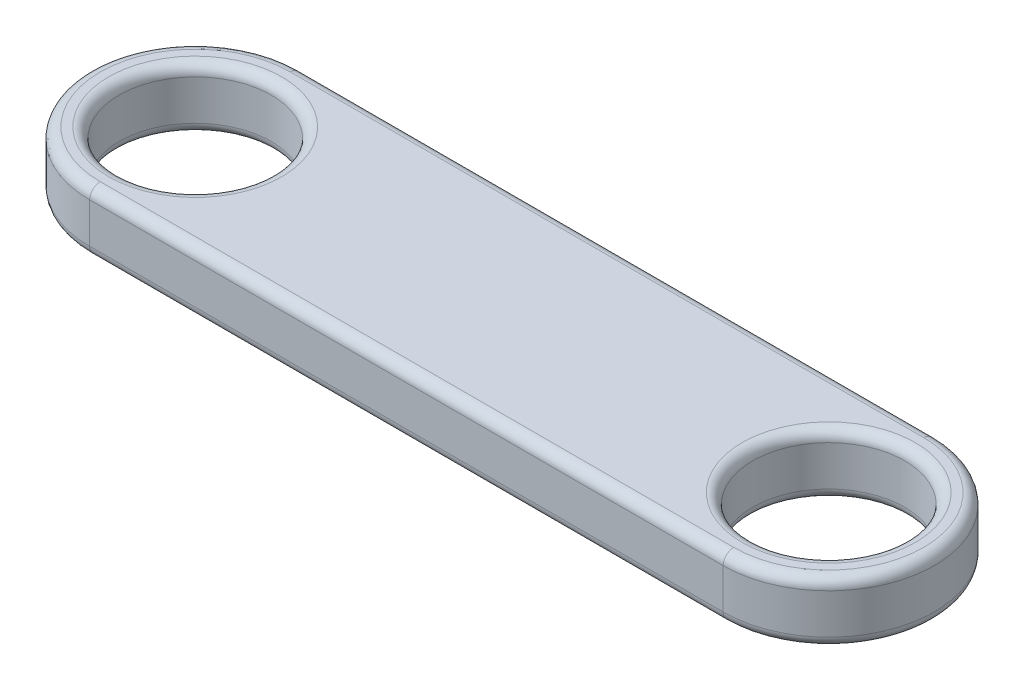
ISO-10303-21;
HEADER;
FILE_DESCRIPTION(('STEP AP214'),'2;1');
FILE_NAME('part.step','',(''),(''),'','','');
FILE_SCHEMA(('AUTOMOTIVE_DESIGN { 1 0 10303 214 1 1 1 1 }'));
ENDSEC;
DATA;
#1=APPLICATION_CONTEXT('core data for automotive mechanical design processes');
#2=APPLICATION_PROTOCOL_DEFINITION('international standard','automotive_design',2000,#1);
#3=PRODUCT_CONTEXT('',#1,'mechanical');
#4=PRODUCT('Part','Part','',(#3));
#5=PRODUCT_RELATED_PRODUCT_CATEGORY('part','',(#4));
#6=PRODUCT_DEFINITION_FORMATION('','',#4);
#7=PRODUCT_DEFINITION_CONTEXT('part definition',#1,'design');
#8=PRODUCT_DEFINITION('design','',#6,#7);
#9=PRODUCT_DEFINITION_SHAPE('','',#8);
#10=(LENGTH_UNIT() NAMED_UNIT(*) SI_UNIT(.MILLI.,.METRE.));
#11=(NAMED_UNIT(*) PLANE_ANGLE_UNIT() SI_UNIT($,.RADIAN.));
#12=(NAMED_UNIT(*) SI_UNIT($,.STERADIAN.) SOLID_ANGLE_UNIT());
#13=UNCERTAINTY_MEASURE_WITH_UNIT(LENGTH_MEASURE(1.E-05),#10,'distance_accuracy_value','');
#14=(GEOMETRIC_REPRESENTATION_CONTEXT(3) GLOBAL_UNCERTAINTY_ASSIGNED_CONTEXT((#13)) GLOBAL_UNIT_ASSIGNED_CONTEXT((#10,
#11,#12)) REPRESENTATION_CONTEXT('',''));
#15=CARTESIAN_POINT('',(0.,0.,0.));
#16=DIRECTION('',(0.,0.,1.));
#17=DIRECTION('',(1.,0.,0.));
#18=AXIS2_PLACEMENT_3D('',#15,#16,#17);
#19=CARTESIAN_POINT('',(0.,2.9,0.));
#20=DIRECTION('',(0.,1.,0.));
#21=DIRECTION('',(0.,0.,1.));
#22=AXIS2_PLACEMENT_3D('',#19,#20,#21);
#23=PLANE('',#22);
#24=CARTESIAN_POINT('',(30.,2.9,0.));
#25=DIRECTION('',(0.,1.,0.));
#26=DIRECTION('',(0.,0.,1.));
#27=AXIS2_PLACEMENT_3D('',#24,#25,#26);
#28=CIRCLE('',#27,4.1);
#29=CARTESIAN_POINT('',(30.,2.9,4.1));
#30=VERTEX_POINT('',#29);
#31=EDGE_CURVE('E197',#30,#30,#28,.F.);
#32=ORIENTED_EDGE('',*,*,#31,.T.);
#33=EDGE_LOOP('',(#32));
#34=FACE_BOUND('',#33,.T.);
#35=CARTESIAN_POINT('',(0.,2.9,0.));
#36=DIRECTION('',(0.,1.,0.));
#37=DIRECTION('',(0.,0.,1.));
#38=AXIS2_PLACEMENT_3D('',#35,#36,#37);
#39=CIRCLE('',#38,4.1);
#40=CARTESIAN_POINT('',(0.,2.9,4.1));
#41=VERTEX_POINT('',#40);
#42=EDGE_CURVE('E194',#41,#41,#39,.F.);
#43=ORIENTED_EDGE('',*,*,#42,.T.);
#44=EDGE_LOOP('',(#43));
#45=FACE_BOUND('',#44,.T.);
#46=DIRECTION('',(-1.,0.,0.));
#47=VECTOR('',#46,1.);
#48=CARTESIAN_POINT('',(0.,2.9,-4.5));
#49=LINE('',#48,#47);
#50=CARTESIAN_POINT('',(30.,2.9,-4.5));
#51=VERTEX_POINT('',#50);
#52=CARTESIAN_POINT('',(0.,2.9,-4.5));
#53=VERTEX_POINT('',#52);
#54=EDGE_CURVE('E49',#51,#53,#49,.T.);
#55=ORIENTED_EDGE('',*,*,#54,.T.);
#56=CARTESIAN_POINT('',(0.,2.9,0.));
#57=DIRECTION('',(0.,1.,0.));
#58=DIRECTION('',(0.,0.,1.));
#59=AXIS2_PLACEMENT_3D('',#56,#57,#58);
#60=CIRCLE('',#59,4.5);
#61=CARTESIAN_POINT('',(0.,2.9,4.5));
#62=VERTEX_POINT('',#61);
#63=EDGE_CURVE('E192',#53,#62,#60,.T.);
#64=ORIENTED_EDGE('',*,*,#63,.T.);
#65=DIRECTION('',(1.,0.,0.));
#66=VECTOR('',#65,1.);
#67=CARTESIAN_POINT('',(30.,2.9,4.5));
#68=LINE('',#67,#66);
#69=CARTESIAN_POINT('',(30.,2.9,4.5));
#70=VERTEX_POINT('',#69);
#71=EDGE_CURVE('E130',#62,#70,#68,.T.);
#72=ORIENTED_EDGE('',*,*,#71,.T.);
#73=CARTESIAN_POINT('',(30.,2.9,0.));
#74=DIRECTION('',(0.,1.,0.));
#75=DIRECTION('',(0.,0.,1.));
#76=AXIS2_PLACEMENT_3D('',#73,#74,#75);
#77=CIRCLE('',#76,4.5);
#78=EDGE_CURVE('E54',#70,#51,#77,.T.);
#79=ORIENTED_EDGE('',*,*,#78,.T.);
#80=EDGE_LOOP('',(#55,#64,#72,#79));
#81=FACE_BOUND('',#80,.T.);
#82=ADVANCED_FACE('F32',(#34,#45,#81),#23,.T.);
#83=CARTESIAN_POINT('',(0.,0.,0.));
#84=DIRECTION('',(0.,1.,0.));
#85=DIRECTION('',(0.,0.,1.));
#86=AXIS2_PLACEMENT_3D('',#83,#84,#85);
#87=PLANE('',#86);
#88=CARTESIAN_POINT('',(30.,0.,0.));
#89=DIRECTION('',(0.,1.,0.));
#90=DIRECTION('',(0.,0.,1.));
#91=AXIS2_PLACEMENT_3D('',#88,#89,#90);
#92=CIRCLE('',#91,4.1);
#93=CARTESIAN_POINT('',(30.,0.,4.1));
#94=VERTEX_POINT('',#93);
#95=EDGE_CURVE('E178',#94,#94,#92,.T.);
#96=ORIENTED_EDGE('',*,*,#95,.T.);
#97=EDGE_LOOP('',(#96));
#98=FACE_BOUND('',#97,.T.);
#99=CARTESIAN_POINT('',(0.,0.,0.));
#100=DIRECTION('',(0.,1.,0.));
#101=DIRECTION('',(0.,0.,1.));
#102=AXIS2_PLACEMENT_3D('',#99,#100,#101);
#103=CIRCLE('',#102,4.1);
#104=CARTESIAN_POINT('',(0.,0.,4.1));
#105=VERTEX_POINT('',#104);
#106=EDGE_CURVE('E175',#105,#105,#103,.T.);
#107=ORIENTED_EDGE('',*,*,#106,.T.);
#108=EDGE_LOOP('',(#107));
#109=FACE_BOUND('',#108,.T.);
#110=DIRECTION('',(1.,0.,0.));
#111=VECTOR('',#110,1.);
#112=CARTESIAN_POINT('',(0.,0.,4.5));
#113=LINE('',#112,#111);
#114=CARTESIAN_POINT('',(30.,0.,4.5));
#115=VERTEX_POINT('',#114);
#116=CARTESIAN_POINT('',(0.,0.,4.5));
#117=VERTEX_POINT('',#116);
#118=EDGE_CURVE('E166',#115,#117,#113,.F.);
#119=ORIENTED_EDGE('',*,*,#118,.T.);
#120=CARTESIAN_POINT('',(0.,0.,0.));
#121=DIRECTION('',(0.,1.,0.));
#122=DIRECTION('',(0.,0.,1.));
#123=AXIS2_PLACEMENT_3D('',#120,#121,#122);
#124=CIRCLE('',#123,4.5);
#125=CARTESIAN_POINT('',(0.,0.,-4.5));
#126=VERTEX_POINT('',#125);
#127=EDGE_CURVE('E172',#117,#126,#124,.F.);
#128=ORIENTED_EDGE('',*,*,#127,.T.);
#129=DIRECTION('',(-1.,0.,0.));
#130=VECTOR('',#129,1.);
#131=CARTESIAN_POINT('',(0.,0.,-4.5));
#132=LINE('',#131,#130);
#133=CARTESIAN_POINT('',(30.,0.,-4.5));
#134=VERTEX_POINT('',#133);
#135=EDGE_CURVE('E170',#126,#134,#132,.F.);
#136=ORIENTED_EDGE('',*,*,#135,.T.);
#137=CARTESIAN_POINT('',(30.,0.,0.));
#138=DIRECTION('',(0.,1.,0.));
#139=DIRECTION('',(0.,0.,1.));
#140=AXIS2_PLACEMENT_3D('',#137,#138,#139);
#141=CIRCLE('',#140,4.5);
#142=EDGE_CURVE('E168',#134,#115,#141,.F.);
#143=ORIENTED_EDGE('',*,*,#142,.T.);
#144=EDGE_LOOP('',(#119,#128,#136,#143));
#145=FACE_BOUND('',#144,.T.);
#146=ADVANCED_FACE('F229',(#98,#109,#145),#87,.F.);
#147=CARTESIAN_POINT('',(0.,2.9,0.));
#148=DIRECTION('',(0.,-1.,0.));
#149=DIRECTION('',(0.,0.,-1.));
#150=AXIS2_PLACEMENT_3D('',#147,#148,#149);
#151=CYLINDRICAL_SURFACE('',#150,5.);
#152=DIRECTION('',(0.,-1.,0.));
#153=VECTOR('',#152,1.);
#154=CARTESIAN_POINT('',(0.,2.9,-5.));
#155=LINE('',#154,#153);
#156=CARTESIAN_POINT('',(0.,2.4,-5.));
#157=VERTEX_POINT('',#156);
#158=CARTESIAN_POINT('',(0.,0.5,-5.));
#159=VERTEX_POINT('',#158);
#160=EDGE_CURVE('E153',#157,#159,#155,.T.);
#161=ORIENTED_EDGE('',*,*,#160,.T.);
#162=CARTESIAN_POINT('',(0.,0.5,0.));
#163=DIRECTION('',(0.,1.,0.));
#164=DIRECTION('',(0.,0.,1.));
#165=AXIS2_PLACEMENT_3D('',#162,#163,#164);
#166=CIRCLE('',#165,5.);
#167=CARTESIAN_POINT('',(0.,0.5,5.));
#168=VERTEX_POINT('',#167);
#169=EDGE_CURVE('E119',#159,#168,#166,.T.);
#170=ORIENTED_EDGE('',*,*,#169,.T.);
#171=DIRECTION('',(0.,-1.,0.));
#172=VECTOR('',#171,1.);
#173=CARTESIAN_POINT('',(0.,2.9,5.));
#174=LINE('',#173,#172);
#175=CARTESIAN_POINT('',(0.,2.4,5.));
#176=VERTEX_POINT('',#175);
#177=EDGE_CURVE('E101',#176,#168,#174,.T.);
#178=ORIENTED_EDGE('',*,*,#177,.F.);
#179=CARTESIAN_POINT('',(0.,2.4,0.));
#180=DIRECTION('',(0.,1.,0.));
#181=DIRECTION('',(0.,0.,1.));
#182=AXIS2_PLACEMENT_3D('',#179,#180,#181);
#183=CIRCLE('',#182,5.);
#184=EDGE_CURVE('E116',#176,#157,#183,.F.);
#185=ORIENTED_EDGE('',*,*,#184,.T.);
#186=EDGE_LOOP('',(#161,#170,#178,#185));
#187=FACE_BOUND('',#186,.T.);
#188=ADVANCED_FACE('F115',(#187),#151,.T.);
#189=CARTESIAN_POINT('',(0.,2.9,5.));
#190=DIRECTION('',(0.,0.,-1.));
#191=DIRECTION('',(-1.,0.,0.));
#192=AXIS2_PLACEMENT_3D('',#189,#190,#191);
#193=PLANE('',#192);
#194=ORIENTED_EDGE('',*,*,#177,.T.);
#195=DIRECTION('',(1.,0.,0.));
#196=VECTOR('',#195,1.);
#197=CARTESIAN_POINT('',(0.,0.5,5.));
#198=LINE('',#197,#196);
#199=CARTESIAN_POINT('',(30.,0.5,5.));
#200=VERTEX_POINT('',#199);
#201=EDGE_CURVE('E11',#168,#200,#198,.T.);
#202=ORIENTED_EDGE('',*,*,#201,.T.);
#203=DIRECTION('',(0.,-1.,0.));
#204=VECTOR('',#203,1.);
#205=CARTESIAN_POINT('',(30.,2.9,5.));
#206=LINE('',#205,#204);
#207=CARTESIAN_POINT('',(30.,2.4,5.));
#208=VERTEX_POINT('',#207);
#209=EDGE_CURVE('E103',#208,#200,#206,.T.);
#210=ORIENTED_EDGE('',*,*,#209,.F.);
#211=DIRECTION('',(1.,0.,0.));
#212=VECTOR('',#211,1.);
#213=CARTESIAN_POINT('',(0.,2.4,5.));
#214=LINE('',#213,#212);
#215=EDGE_CURVE('E41',#208,#176,#214,.F.);
#216=ORIENTED_EDGE('',*,*,#215,.T.);
#217=EDGE_LOOP('',(#194,#202,#210,#216));
#218=FACE_BOUND('',#217,.T.);
#219=ADVANCED_FACE('F100',(#218),#193,.F.);
#220=CARTESIAN_POINT('',(30.,2.9,0.));
#221=DIRECTION('',(0.,-1.,0.));
#222=DIRECTION('',(0.,0.,-1.));
#223=AXIS2_PLACEMENT_3D('',#220,#221,#222);
#224=CYLINDRICAL_SURFACE('',#223,5.);
#225=ORIENTED_EDGE('',*,*,#209,.T.);
#226=CARTESIAN_POINT('',(30.,0.5,0.));
#227=DIRECTION('',(0.,1.,0.));
#228=DIRECTION('',(0.,0.,1.));
#229=AXIS2_PLACEMENT_3D('',#226,#227,#228);
#230=CIRCLE('',#229,5.);
#231=CARTESIAN_POINT('',(30.,0.5,-5.));
#232=VERTEX_POINT('',#231);
#233=EDGE_CURVE('E187',#200,#232,#230,.T.);
#234=ORIENTED_EDGE('',*,*,#233,.T.);
#235=DIRECTION('',(0.,-1.,0.));
#236=VECTOR('',#235,1.);
#237=CARTESIAN_POINT('',(30.,2.9,-5.));
#238=LINE('',#237,#236);
#239=CARTESIAN_POINT('',(30.,2.4,-5.));
#240=VERTEX_POINT('',#239);
#241=EDGE_CURVE('E158',#240,#232,#238,.T.);
#242=ORIENTED_EDGE('',*,*,#241,.F.);
#243=CARTESIAN_POINT('',(30.,2.4,0.));
#244=DIRECTION('',(0.,1.,0.));
#245=DIRECTION('',(0.,0.,1.));
#246=AXIS2_PLACEMENT_3D('',#243,#244,#245);
#247=CIRCLE('',#246,5.);
#248=EDGE_CURVE('E185',#240,#208,#247,.F.);
#249=ORIENTED_EDGE('',*,*,#248,.T.);
#250=EDGE_LOOP('',(#225,#234,#242,#249));
#251=FACE_BOUND('',#250,.T.);
#252=ADVANCED_FACE('F244',(#251),#224,.T.);
#253=CARTESIAN_POINT('',(0.,2.9,-5.));
#254=DIRECTION('',(0.,0.,1.));
#255=DIRECTION('',(1.,0.,0.));
#256=AXIS2_PLACEMENT_3D('',#253,#254,#255);
#257=PLANE('',#256);
#258=ORIENTED_EDGE('',*,*,#241,.T.);
#259=DIRECTION('',(-1.,0.,0.));
#260=VECTOR('',#259,1.);
#261=CARTESIAN_POINT('',(0.,0.5,-5.));
#262=LINE('',#261,#260);
#263=EDGE_CURVE('E183',#232,#159,#262,.T.);
#264=ORIENTED_EDGE('',*,*,#263,.T.);
#265=ORIENTED_EDGE('',*,*,#160,.F.);
#266=DIRECTION('',(-1.,0.,0.));
#267=VECTOR('',#266,1.);
#268=CARTESIAN_POINT('',(30.,2.4,-5.));
#269=LINE('',#268,#267);
#270=EDGE_CURVE('E181',#157,#240,#269,.F.);
#271=ORIENTED_EDGE('',*,*,#270,.T.);
#272=EDGE_LOOP('',(#258,#264,#265,#271));
#273=FACE_BOUND('',#272,.T.);
#274=ADVANCED_FACE('F241',(#273),#257,.F.);
#275=CARTESIAN_POINT('',(0.,2.9,0.));
#276=DIRECTION('',(0.,-1.,0.));
#277=DIRECTION('',(0.,0.,-1.));
#278=AXIS2_PLACEMENT_3D('',#275,#276,#277);
#279=CYLINDRICAL_SURFACE('',#278,3.6);
#280=CARTESIAN_POINT('',(0.,2.4,0.));
#281=DIRECTION('',(0.,1.,0.));
#282=DIRECTION('',(0.,0.,1.));
#283=AXIS2_PLACEMENT_3D('',#280,#281,#282);
#284=CIRCLE('',#283,3.6);
#285=CARTESIAN_POINT('',(0.,2.4,3.6));
#286=VERTEX_POINT('',#285);
#287=EDGE_CURVE('E108',#286,#286,#284,.T.);
#288=ORIENTED_EDGE('',*,*,#287,.T.);
#289=EDGE_LOOP('',(#288));
#290=FACE_BOUND('',#289,.T.);
#291=CARTESIAN_POINT('',(0.,0.5,0.));
#292=DIRECTION('',(0.,1.,0.));
#293=DIRECTION('',(0.,0.,1.));
#294=AXIS2_PLACEMENT_3D('',#291,#292,#293);
#295=CIRCLE('',#294,3.6);
#296=CARTESIAN_POINT('',(0.,0.5,3.6));
#297=VERTEX_POINT('',#296);
#298=EDGE_CURVE('E206',#297,#297,#295,.F.);
#299=ORIENTED_EDGE('',*,*,#298,.T.);
#300=EDGE_LOOP('',(#299));
#301=FACE_BOUND('',#300,.T.);
#302=ADVANCED_FACE('F212',(#290,#301),#279,.F.);
#303=CARTESIAN_POINT('',(30.,2.9,0.));
#304=DIRECTION('',(0.,-1.,0.));
#305=DIRECTION('',(0.,0.,-1.));
#306=AXIS2_PLACEMENT_3D('',#303,#304,#305);
#307=CYLINDRICAL_SURFACE('',#306,3.6);
#308=CARTESIAN_POINT('',(30.,2.4,0.));
#309=DIRECTION('',(0.,1.,0.));
#310=DIRECTION('',(0.,0.,1.));
#311=AXIS2_PLACEMENT_3D('',#308,#309,#310);
#312=CIRCLE('',#311,3.6);
#313=CARTESIAN_POINT('',(30.,2.4,3.6));
#314=VERTEX_POINT('',#313);
#315=EDGE_CURVE('E203',#314,#314,#312,.T.);
#316=ORIENTED_EDGE('',*,*,#315,.T.);
#317=EDGE_LOOP('',(#316));
#318=FACE_BOUND('',#317,.T.);
#319=CARTESIAN_POINT('',(30.,0.5,0.));
#320=DIRECTION('',(0.,1.,0.));
#321=DIRECTION('',(0.,0.,1.));
#322=AXIS2_PLACEMENT_3D('',#319,#320,#321);
#323=CIRCLE('',#322,3.6);
#324=CARTESIAN_POINT('',(30.,0.5,3.6));
#325=VERTEX_POINT('',#324);
#326=EDGE_CURVE('E200',#325,#325,#323,.F.);
#327=ORIENTED_EDGE('',*,*,#326,.T.);
#328=EDGE_LOOP('',(#327));
#329=FACE_BOUND('',#328,.T.);
#330=ADVANCED_FACE('F266',(#318,#329),#307,.F.);
#331=CARTESIAN_POINT('',(30.,0.5,0.));
#332=DIRECTION('',(0.,1.,0.));
#333=DIRECTION('',(0.,0.,1.));
#334=AXIS2_PLACEMENT_3D('',#331,#332,#333);
#335=TOROIDAL_SURFACE('',#334,4.5,0.5);
#336=CARTESIAN_POINT('',(30.,0.5,4.5));
#337=DIRECTION('',(-1.,0.,0.));
#338=DIRECTION('',(0.,0.,1.));
#339=AXIS2_PLACEMENT_3D('',#336,#337,#338);
#340=CIRCLE('',#339,0.5);
#341=EDGE_CURVE('E146',#115,#200,#340,.T.);
#342=ORIENTED_EDGE('',*,*,#341,.F.);
#343=ORIENTED_EDGE('',*,*,#142,.F.);
#344=CARTESIAN_POINT('',(30.,0.5,-4.5));
#345=DIRECTION('',(-1.,0.,0.));
#346=DIRECTION('',(0.,0.,1.));
#347=AXIS2_PLACEMENT_3D('',#344,#345,#346);
#348=CIRCLE('',#347,0.5);
#349=EDGE_CURVE('E135',#232,#134,#348,.T.);
#350=ORIENTED_EDGE('',*,*,#349,.F.);
#351=ORIENTED_EDGE('',*,*,#233,.F.);
#352=EDGE_LOOP('',(#342,#343,#350,#351));
#353=FACE_BOUND('',#352,.T.);
#354=ADVANCED_FACE('F263',(#353),#335,.T.);
#355=CARTESIAN_POINT('',(0.,0.5,-4.5));
#356=DIRECTION('',(-1.,0.,0.));
#357=DIRECTION('',(0.,0.,1.));
#358=AXIS2_PLACEMENT_3D('',#355,#356,#357);
#359=CYLINDRICAL_SURFACE('',#358,0.5);
#360=ORIENTED_EDGE('',*,*,#349,.T.);
#361=ORIENTED_EDGE('',*,*,#135,.F.);
#362=CARTESIAN_POINT('',(0.,0.5,-4.5));
#363=DIRECTION('',(-1.,0.,0.));
#364=DIRECTION('',(0.,0.,1.));
#365=AXIS2_PLACEMENT_3D('',#362,#363,#364);
#366=CIRCLE('',#365,0.5);
#367=EDGE_CURVE('E140',#159,#126,#366,.T.);
#368=ORIENTED_EDGE('',*,*,#367,.F.);
#369=ORIENTED_EDGE('',*,*,#263,.F.);
#370=EDGE_LOOP('',(#360,#361,#368,#369));
#371=FACE_BOUND('',#370,.T.);
#372=ADVANCED_FACE('F260',(#371),#359,.T.);
#373=CARTESIAN_POINT('',(0.,0.5,4.5));
#374=DIRECTION('',(1.,0.,0.));
#375=DIRECTION('',(0.,0.,-1.));
#376=AXIS2_PLACEMENT_3D('',#373,#374,#375);
#377=CYLINDRICAL_SURFACE('',#376,0.5);
#378=ORIENTED_EDGE('',*,*,#341,.T.);
#379=ORIENTED_EDGE('',*,*,#201,.F.);
#380=CARTESIAN_POINT('',(0.,0.5,4.5));
#381=DIRECTION('',(-1.,0.,0.));
#382=DIRECTION('',(0.,0.,1.));
#383=AXIS2_PLACEMENT_3D('',#380,#381,#382);
#384=CIRCLE('',#383,0.5);
#385=EDGE_CURVE('E138',#117,#168,#384,.T.);
#386=ORIENTED_EDGE('',*,*,#385,.F.);
#387=ORIENTED_EDGE('',*,*,#118,.F.);
#388=EDGE_LOOP('',(#378,#379,#386,#387));
#389=FACE_BOUND('',#388,.T.);
#390=ADVANCED_FACE('F257',(#389),#377,.T.);
#391=CARTESIAN_POINT('',(0.,0.5,0.));
#392=DIRECTION('',(0.,1.,0.));
#393=DIRECTION('',(0.,0.,1.));
#394=AXIS2_PLACEMENT_3D('',#391,#392,#393);
#395=TOROIDAL_SURFACE('',#394,4.5,0.5);
#396=ORIENTED_EDGE('',*,*,#367,.T.);
#397=ORIENTED_EDGE('',*,*,#127,.F.);
#398=ORIENTED_EDGE('',*,*,#385,.T.);
#399=ORIENTED_EDGE('',*,*,#169,.F.);
#400=EDGE_LOOP('',(#396,#397,#398,#399));
#401=FACE_BOUND('',#400,.T.);
#402=ADVANCED_FACE('F253',(#401),#395,.T.);
#403=CARTESIAN_POINT('',(30.,2.4,0.));
#404=DIRECTION('',(0.,1.,0.));
#405=DIRECTION('',(0.,0.,1.));
#406=AXIS2_PLACEMENT_3D('',#403,#404,#405);
#407=TOROIDAL_SURFACE('',#406,4.5,0.5);
#408=CARTESIAN_POINT('',(30.,2.4,4.5));
#409=DIRECTION('',(-1.,0.,0.));
#410=DIRECTION('',(0.,0.,1.));
#411=AXIS2_PLACEMENT_3D('',#408,#409,#410);
#412=CIRCLE('',#411,0.5);
#413=EDGE_CURVE('E132',#208,#70,#412,.T.);
#414=ORIENTED_EDGE('',*,*,#413,.F.);
#415=ORIENTED_EDGE('',*,*,#248,.F.);
#416=CARTESIAN_POINT('',(30.,2.4,-4.5));
#417=DIRECTION('',(-1.,0.,0.));
#418=DIRECTION('',(0.,0.,1.));
#419=AXIS2_PLACEMENT_3D('',#416,#417,#418);
#420=CIRCLE('',#419,0.5);
#421=EDGE_CURVE('E36',#51,#240,#420,.T.);
#422=ORIENTED_EDGE('',*,*,#421,.F.);
#423=ORIENTED_EDGE('',*,*,#78,.F.);
#424=EDGE_LOOP('',(#414,#415,#422,#423));
#425=FACE_BOUND('',#424,.T.);
#426=ADVANCED_FACE('F256',(#425),#407,.T.);
#427=CARTESIAN_POINT('',(0.,2.4,-4.5));
#428=DIRECTION('',(1.,0.,0.));
#429=DIRECTION('',(0.,0.,-1.));
#430=AXIS2_PLACEMENT_3D('',#427,#428,#429);
#431=CYLINDRICAL_SURFACE('',#430,0.5);
#432=ORIENTED_EDGE('',*,*,#421,.T.);
#433=ORIENTED_EDGE('',*,*,#270,.F.);
#434=CARTESIAN_POINT('',(0.,2.4,-4.5));
#435=DIRECTION('',(-1.,0.,0.));
#436=DIRECTION('',(0.,0.,1.));
#437=AXIS2_PLACEMENT_3D('',#434,#435,#436);
#438=CIRCLE('',#437,0.5);
#439=EDGE_CURVE('E126',#53,#157,#438,.T.);
#440=ORIENTED_EDGE('',*,*,#439,.F.);
#441=ORIENTED_EDGE('',*,*,#54,.F.);
#442=EDGE_LOOP('',(#432,#433,#440,#441));
#443=FACE_BOUND('',#442,.T.);
#444=ADVANCED_FACE('F272',(#443),#431,.T.);
#445=CARTESIAN_POINT('',(0.,2.4,4.5));
#446=DIRECTION('',(-1.,0.,0.));
#447=DIRECTION('',(0.,0.,1.));
#448=AXIS2_PLACEMENT_3D('',#445,#446,#447);
#449=CYLINDRICAL_SURFACE('',#448,0.5);
#450=ORIENTED_EDGE('',*,*,#413,.T.);
#451=ORIENTED_EDGE('',*,*,#71,.F.);
#452=CARTESIAN_POINT('',(0.,2.4,4.5));
#453=DIRECTION('',(-1.,0.,0.));
#454=DIRECTION('',(0.,0.,1.));
#455=AXIS2_PLACEMENT_3D('',#452,#453,#454);
#456=CIRCLE('',#455,0.5);
#457=EDGE_CURVE('E124',#176,#62,#456,.T.);
#458=ORIENTED_EDGE('',*,*,#457,.F.);
#459=ORIENTED_EDGE('',*,*,#215,.F.);
#460=EDGE_LOOP('',(#450,#451,#458,#459));
#461=FACE_BOUND('',#460,.T.);
#462=ADVANCED_FACE('F129',(#461),#449,.T.);
#463=CARTESIAN_POINT('',(0.,2.4,0.));
#464=DIRECTION('',(0.,1.,0.));
#465=DIRECTION('',(0.,0.,1.));
#466=AXIS2_PLACEMENT_3D('',#463,#464,#465);
#467=TOROIDAL_SURFACE('',#466,4.5,0.5);
#468=ORIENTED_EDGE('',*,*,#439,.T.);
#469=ORIENTED_EDGE('',*,*,#184,.F.);
#470=ORIENTED_EDGE('',*,*,#457,.T.);
#471=ORIENTED_EDGE('',*,*,#63,.F.);
#472=EDGE_LOOP('',(#468,#469,#470,#471));
#473=FACE_BOUND('',#472,.T.);
#474=ADVANCED_FACE('F122',(#473),#467,.T.);
#475=CARTESIAN_POINT('',(30.,2.4,0.));
#476=DIRECTION('',(0.,1.,0.));
#477=DIRECTION('',(0.,0.,1.));
#478=AXIS2_PLACEMENT_3D('',#475,#476,#477);
#479=TOROIDAL_SURFACE('',#478,4.1,0.5);
#480=ORIENTED_EDGE('',*,*,#31,.F.);
#481=EDGE_LOOP('',(#480));
#482=FACE_BOUND('',#481,.T.);
#483=ORIENTED_EDGE('',*,*,#315,.F.);
#484=EDGE_LOOP('',(#483));
#485=FACE_BOUND('',#484,.T.);
#486=ADVANCED_FACE('F224',(#482,#485),#479,.T.);
#487=CARTESIAN_POINT('',(30.,0.5,0.));
#488=DIRECTION('',(0.,1.,0.));
#489=DIRECTION('',(0.,0.,1.));
#490=AXIS2_PLACEMENT_3D('',#487,#488,#489);
#491=TOROIDAL_SURFACE('',#490,4.1,0.5);
#492=ORIENTED_EDGE('',*,*,#326,.F.);
#493=EDGE_LOOP('',(#492));
#494=FACE_BOUND('',#493,.T.);
#495=ORIENTED_EDGE('',*,*,#95,.F.);
#496=EDGE_LOOP('',(#495));
#497=FACE_BOUND('',#496,.T.);
#498=ADVANCED_FACE('F217',(#494,#497),#491,.T.);
#499=CARTESIAN_POINT('',(0.,2.4,0.));
#500=DIRECTION('',(0.,1.,0.));
#501=DIRECTION('',(0.,0.,1.));
#502=AXIS2_PLACEMENT_3D('',#499,#500,#501);
#503=TOROIDAL_SURFACE('',#502,4.1,0.5);
#504=ORIENTED_EDGE('',*,*,#42,.F.);
#505=EDGE_LOOP('',(#504));
#506=FACE_BOUND('',#505,.T.);
#507=ORIENTED_EDGE('',*,*,#287,.F.);
#508=EDGE_LOOP('',(#507));
#509=FACE_BOUND('',#508,.T.);
#510=ADVANCED_FACE('F215',(#506,#509),#503,.T.);
#511=CARTESIAN_POINT('',(0.,0.5,0.));
#512=DIRECTION('',(0.,1.,0.));
#513=DIRECTION('',(0.,0.,1.));
#514=AXIS2_PLACEMENT_3D('',#511,#512,#513);
#515=TOROIDAL_SURFACE('',#514,4.1,0.5);
#516=ORIENTED_EDGE('',*,*,#298,.F.);
#517=EDGE_LOOP('',(#516));
#518=FACE_BOUND('',#517,.T.);
#519=ORIENTED_EDGE('',*,*,#106,.F.);
#520=EDGE_LOOP('',(#519));
#521=FACE_BOUND('',#520,.T.);
#522=ADVANCED_FACE('F34',(#518,#521),#515,.T.);
#523=CLOSED_SHELL('',(#82,#146,#188,#219,#252,#274,#302,#330,#354,#372,#390,#402,#426,#444,#462,
#474,#486,#498,#510,#522));
#524=MANIFOLD_SOLID_BREP('B2',#523);
#525=ADVANCED_BREP_SHAPE_REPRESENTATION('',(#18,#524),#14);
#526=SHAPE_DEFINITION_REPRESENTATION(#9,#525);
ENDSEC;
END-ISO-10303-21;
